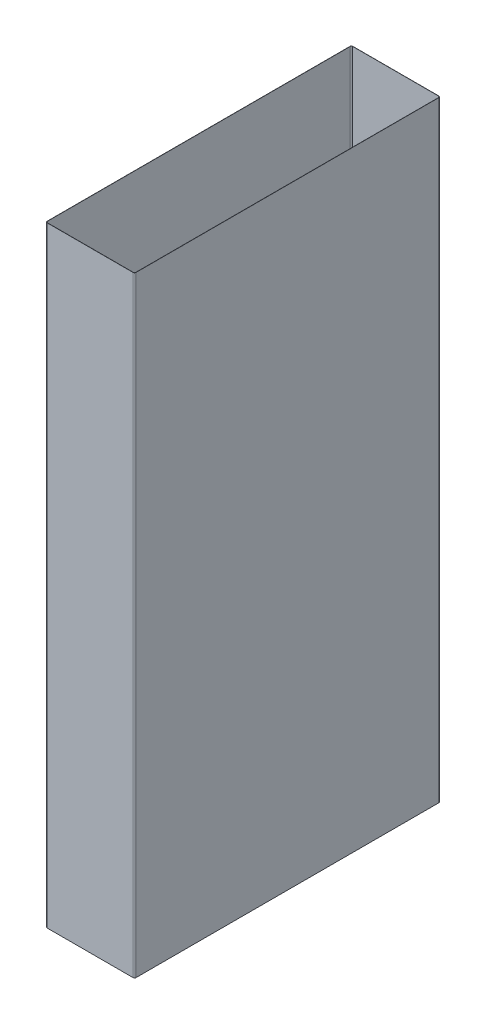
ISO-10303-21;
HEADER;
FILE_DESCRIPTION(('STEP AP214'),'2;1');
FILE_NAME('part.step','',(''),(''),'','','');
FILE_SCHEMA(('AUTOMOTIVE_DESIGN { 1 0 10303 214 1 1 1 1 }'));
ENDSEC;
DATA;
#1=APPLICATION_CONTEXT('core data for automotive mechanical design processes');
#2=APPLICATION_PROTOCOL_DEFINITION('international standard','automotive_design',2000,#1);
#3=PRODUCT_CONTEXT('',#1,'mechanical');
#4=PRODUCT('Part','Part','',(#3));
#5=PRODUCT_RELATED_PRODUCT_CATEGORY('part','',(#4));
#6=PRODUCT_DEFINITION_FORMATION('','',#4);
#7=PRODUCT_DEFINITION_CONTEXT('part definition',#1,'design');
#8=PRODUCT_DEFINITION('design','',#6,#7);
#9=PRODUCT_DEFINITION_SHAPE('','',#8);
#10=(LENGTH_UNIT() NAMED_UNIT(*) SI_UNIT(.MILLI.,.METRE.));
#11=(NAMED_UNIT(*) PLANE_ANGLE_UNIT() SI_UNIT($,.RADIAN.));
#12=(NAMED_UNIT(*) SI_UNIT($,.STERADIAN.) SOLID_ANGLE_UNIT());
#13=UNCERTAINTY_MEASURE_WITH_UNIT(LENGTH_MEASURE(1.E-05),#10,'distance_accuracy_value','');
#14=(GEOMETRIC_REPRESENTATION_CONTEXT(3) GLOBAL_UNCERTAINTY_ASSIGNED_CONTEXT((#13)) GLOBAL_UNIT_ASSIGNED_CONTEXT((#10,
#11,#12)) REPRESENTATION_CONTEXT('',''));
#15=CARTESIAN_POINT('',(0.,0.,0.));
#16=DIRECTION('',(0.,0.,1.));
#17=DIRECTION('',(1.,0.,0.));
#18=AXIS2_PLACEMENT_3D('',#15,#16,#17);
#19=CARTESIAN_POINT('',(1.,484.8,-1.));
#20=DIRECTION('',(0.,-1.,0.));
#21=DIRECTION('',(0.,0.,-1.));
#22=AXIS2_PLACEMENT_3D('',#19,#20,#21);
#23=PLANE('',#22);
#24=CARTESIAN_POINT('',(1.,484.8,-1.));
#25=DIRECTION('',(0.,-1.,0.));
#26=DIRECTION('',(-1.,0.,0.));
#27=AXIS2_PLACEMENT_3D('',#24,#25,#26);
#28=CIRCLE('',#27,1.15);
#29=CARTESIAN_POINT('',(-0.15,484.8,-1.00000000000001));
#30=VERTEX_POINT('',#29);
#31=CARTESIAN_POINT('',(1.00000000000001,484.8,0.15));
#32=VERTEX_POINT('',#31);
#33=EDGE_CURVE('E261',#30,#32,#28,.F.);
#34=ORIENTED_EDGE('',*,*,#33,.T.);
#35=DIRECTION('',(1.,0.,0.));
#36=VECTOR('',#35,1.);
#37=CARTESIAN_POINT('',(1.,484.8,0.15));
#38=LINE('',#37,#36);
#39=CARTESIAN_POINT('',(69.2,484.8,0.15));
#40=VERTEX_POINT('',#39);
#41=EDGE_CURVE('E264',#32,#40,#38,.T.);
#42=ORIENTED_EDGE('',*,*,#41,.T.);
#43=CARTESIAN_POINT('',(69.2,484.8,-1.));
#44=DIRECTION('',(0.,-1.,0.));
#45=DIRECTION('',(-1.,0.,0.));
#46=AXIS2_PLACEMENT_3D('',#43,#44,#45);
#47=CIRCLE('',#46,1.15);
#48=CARTESIAN_POINT('',(70.35,484.8,-1.));
#49=VERTEX_POINT('',#48);
#50=EDGE_CURVE('E267',#40,#49,#47,.F.);
#51=ORIENTED_EDGE('',*,*,#50,.T.);
#52=DIRECTION('',(0.,0.,-1.));
#53=VECTOR('',#52,1.);
#54=CARTESIAN_POINT('',(70.35,484.8,-1.));
#55=LINE('',#54,#53);
#56=CARTESIAN_POINT('',(70.35,484.8,-241.4));
#57=VERTEX_POINT('',#56);
#58=EDGE_CURVE('E269',#49,#57,#55,.T.);
#59=ORIENTED_EDGE('',*,*,#58,.T.);
#60=CARTESIAN_POINT('',(69.2,484.8,-241.4));
#61=DIRECTION('',(0.,-1.,0.));
#62=DIRECTION('',(-1.,0.,0.));
#63=AXIS2_PLACEMENT_3D('',#60,#61,#62);
#64=CIRCLE('',#63,1.15);
#65=CARTESIAN_POINT('',(69.2,484.8,-242.55));
#66=VERTEX_POINT('',#65);
#67=EDGE_CURVE('E271',#57,#66,#64,.F.);
#68=ORIENTED_EDGE('',*,*,#67,.T.);
#69=DIRECTION('',(-1.,0.,0.));
#70=VECTOR('',#69,1.);
#71=CARTESIAN_POINT('',(1.,484.8,-242.55));
#72=LINE('',#71,#70);
#73=CARTESIAN_POINT('',(1.,484.8,-242.55));
#74=VERTEX_POINT('',#73);
#75=EDGE_CURVE('E273',#66,#74,#72,.T.);
#76=ORIENTED_EDGE('',*,*,#75,.T.);
#77=CARTESIAN_POINT('',(1.,484.8,-241.4));
#78=DIRECTION('',(0.,-1.,0.));
#79=DIRECTION('',(-1.,0.,0.));
#80=AXIS2_PLACEMENT_3D('',#77,#78,#79);
#81=CIRCLE('',#80,1.15);
#82=CARTESIAN_POINT('',(-0.15,484.8,-241.4));
#83=VERTEX_POINT('',#82);
#84=EDGE_CURVE('E275',#74,#83,#81,.F.);
#85=ORIENTED_EDGE('',*,*,#84,.T.);
#86=DIRECTION('',(0.,0.,1.));
#87=VECTOR('',#86,1.);
#88=CARTESIAN_POINT('',(-0.15,484.8,-1.));
#89=LINE('',#88,#87);
#90=EDGE_CURVE('E277',#83,#30,#89,.T.);
#91=ORIENTED_EDGE('',*,*,#90,.T.);
#92=EDGE_LOOP('',(#34,#42,#51,#59,#68,#76,#85,#91));
#93=FACE_BOUND('',#92,.T.);
#94=CARTESIAN_POINT('',(1.,484.8,-1.));
#95=DIRECTION('',(0.,1.,0.));
#96=DIRECTION('',(0.,0.,-1.));
#97=AXIS2_PLACEMENT_3D('',#94,#95,#96);
#98=CIRCLE('',#97,1.);
#99=CARTESIAN_POINT('',(0.,484.8,-1.00000000000001));
#100=VERTEX_POINT('',#99);
#101=CARTESIAN_POINT('',(1.00000000000001,484.8,0.));
#102=VERTEX_POINT('',#101);
#103=EDGE_CURVE('E196',#100,#102,#98,.T.);
#104=ORIENTED_EDGE('',*,*,#103,.F.);
#105=DIRECTION('',(0.,0.,1.));
#106=VECTOR('',#105,1.);
#107=CARTESIAN_POINT('',(0.,484.8,-1.00000000000001));
#108=LINE('',#107,#106);
#109=CARTESIAN_POINT('',(0.,484.8,-241.4));
#110=VERTEX_POINT('',#109);
#111=EDGE_CURVE('E229',#110,#100,#108,.T.);
#112=ORIENTED_EDGE('',*,*,#111,.F.);
#113=CARTESIAN_POINT('',(1.,484.8,-241.4));
#114=DIRECTION('',(0.,1.,0.));
#115=DIRECTION('',(0.,0.,-1.));
#116=AXIS2_PLACEMENT_3D('',#113,#114,#115);
#117=CIRCLE('',#116,1.);
#118=CARTESIAN_POINT('',(1.,484.8,-242.4));
#119=VERTEX_POINT('',#118);
#120=EDGE_CURVE('E227',#119,#110,#117,.T.);
#121=ORIENTED_EDGE('',*,*,#120,.F.);
#122=DIRECTION('',(-1.,0.,0.));
#123=VECTOR('',#122,1.);
#124=CARTESIAN_POINT('',(1.,484.8,-242.4));
#125=LINE('',#124,#123);
#126=CARTESIAN_POINT('',(69.2,484.8,-242.4));
#127=VERTEX_POINT('',#126);
#128=EDGE_CURVE('E225',#127,#119,#125,.T.);
#129=ORIENTED_EDGE('',*,*,#128,.F.);
#130=CARTESIAN_POINT('',(69.2,484.8,-241.4));
#131=DIRECTION('',(0.,1.,0.));
#132=DIRECTION('',(0.,0.,-1.));
#133=AXIS2_PLACEMENT_3D('',#130,#131,#132);
#134=CIRCLE('',#133,1.);
#135=CARTESIAN_POINT('',(70.2,484.8,-241.4));
#136=VERTEX_POINT('',#135);
#137=EDGE_CURVE('E223',#136,#127,#134,.T.);
#138=ORIENTED_EDGE('',*,*,#137,.F.);
#139=DIRECTION('',(0.,0.,-1.));
#140=VECTOR('',#139,1.);
#141=CARTESIAN_POINT('',(70.2,484.8,-1.));
#142=LINE('',#141,#140);
#143=CARTESIAN_POINT('',(70.2,484.8,-1.));
#144=VERTEX_POINT('',#143);
#145=EDGE_CURVE('E219',#144,#136,#142,.T.);
#146=ORIENTED_EDGE('',*,*,#145,.F.);
#147=CARTESIAN_POINT('',(69.2,484.8,-1.));
#148=DIRECTION('',(0.,1.,0.));
#149=DIRECTION('',(0.,0.,1.));
#150=AXIS2_PLACEMENT_3D('',#147,#148,#149);
#151=CIRCLE('',#150,1.);
#152=CARTESIAN_POINT('',(69.2,484.8,0.));
#153=VERTEX_POINT('',#152);
#154=EDGE_CURVE('E217',#153,#144,#151,.T.);
#155=ORIENTED_EDGE('',*,*,#154,.F.);
#156=DIRECTION('',(1.,0.,0.));
#157=VECTOR('',#156,1.);
#158=CARTESIAN_POINT('',(1.00000000000001,484.8,0.));
#159=LINE('',#158,#157);
#160=EDGE_CURVE('E204',#102,#153,#159,.T.);
#161=ORIENTED_EDGE('',*,*,#160,.F.);
#162=EDGE_LOOP('',(#104,#112,#121,#129,#138,#146,#155,#161));
#163=FACE_BOUND('',#162,.T.);
#164=ADVANCED_FACE('F83',(#93,#163),#23,.F.);
#165=CARTESIAN_POINT('',(1.,0.,-1.));
#166=DIRECTION('',(0.,-1.,0.));
#167=DIRECTION('',(0.,0.,-1.));
#168=AXIS2_PLACEMENT_3D('',#165,#166,#167);
#169=PLANE('',#168);
#170=CARTESIAN_POINT('',(1.,0.,-1.));
#171=DIRECTION('',(0.,-1.,0.));
#172=DIRECTION('',(-1.,0.,0.));
#173=AXIS2_PLACEMENT_3D('',#170,#171,#172);
#174=CIRCLE('',#173,1.15);
#175=CARTESIAN_POINT('',(-0.15,0.,-1.00000000000001));
#176=VERTEX_POINT('',#175);
#177=CARTESIAN_POINT('',(1.00000000000001,0.,0.15));
#178=VERTEX_POINT('',#177);
#179=EDGE_CURVE('E212',#176,#178,#174,.F.);
#180=ORIENTED_EDGE('',*,*,#179,.F.);
#181=DIRECTION('',(0.,0.,1.));
#182=VECTOR('',#181,1.);
#183=CARTESIAN_POINT('',(-0.15,0.,-1.));
#184=LINE('',#183,#182);
#185=CARTESIAN_POINT('',(-0.15,0.,-241.4));
#186=VERTEX_POINT('',#185);
#187=EDGE_CURVE('E265',#186,#176,#184,.T.);
#188=ORIENTED_EDGE('',*,*,#187,.F.);
#189=CARTESIAN_POINT('',(1.,0.,-241.4));
#190=DIRECTION('',(0.,-1.,0.));
#191=DIRECTION('',(-1.,0.,0.));
#192=AXIS2_PLACEMENT_3D('',#189,#190,#191);
#193=CIRCLE('',#192,1.15);
#194=CARTESIAN_POINT('',(1.,0.,-242.55));
#195=VERTEX_POINT('',#194);
#196=EDGE_CURVE('E292',#195,#186,#193,.F.);
#197=ORIENTED_EDGE('',*,*,#196,.F.);
#198=DIRECTION('',(-1.,0.,0.));
#199=VECTOR('',#198,1.);
#200=CARTESIAN_POINT('',(1.,0.,-242.55));
#201=LINE('',#200,#199);
#202=CARTESIAN_POINT('',(69.2,0.,-242.55));
#203=VERTEX_POINT('',#202);
#204=EDGE_CURVE('E290',#203,#195,#201,.T.);
#205=ORIENTED_EDGE('',*,*,#204,.F.);
#206=CARTESIAN_POINT('',(69.2,0.,-241.4));
#207=DIRECTION('',(0.,-1.,0.));
#208=DIRECTION('',(-1.,0.,0.));
#209=AXIS2_PLACEMENT_3D('',#206,#207,#208);
#210=CIRCLE('',#209,1.15);
#211=CARTESIAN_POINT('',(70.35,0.,-241.4));
#212=VERTEX_POINT('',#211);
#213=EDGE_CURVE('E288',#212,#203,#210,.F.);
#214=ORIENTED_EDGE('',*,*,#213,.F.);
#215=DIRECTION('',(0.,0.,-1.));
#216=VECTOR('',#215,1.);
#217=CARTESIAN_POINT('',(70.35,0.,-1.));
#218=LINE('',#217,#216);
#219=CARTESIAN_POINT('',(70.35,0.,-1.));
#220=VERTEX_POINT('',#219);
#221=EDGE_CURVE('E286',#220,#212,#218,.T.);
#222=ORIENTED_EDGE('',*,*,#221,.F.);
#223=CARTESIAN_POINT('',(69.2,0.,-1.));
#224=DIRECTION('',(0.,-1.,0.));
#225=DIRECTION('',(-1.,0.,0.));
#226=AXIS2_PLACEMENT_3D('',#223,#224,#225);
#227=CIRCLE('',#226,1.15);
#228=CARTESIAN_POINT('',(69.2,0.,0.15));
#229=VERTEX_POINT('',#228);
#230=EDGE_CURVE('E284',#229,#220,#227,.F.);
#231=ORIENTED_EDGE('',*,*,#230,.F.);
#232=DIRECTION('',(1.,0.,0.));
#233=VECTOR('',#232,1.);
#234=CARTESIAN_POINT('',(1.,0.,0.15));
#235=LINE('',#234,#233);
#236=EDGE_CURVE('E282',#178,#229,#235,.T.);
#237=ORIENTED_EDGE('',*,*,#236,.F.);
#238=EDGE_LOOP('',(#180,#188,#197,#205,#214,#222,#231,#237));
#239=FACE_BOUND('',#238,.T.);
#240=DIRECTION('',(0.,0.,1.));
#241=VECTOR('',#240,1.);
#242=CARTESIAN_POINT('',(0.,0.,-1.00000000000001));
#243=LINE('',#242,#241);
#244=CARTESIAN_POINT('',(0.,0.,-241.4));
#245=VERTEX_POINT('',#244);
#246=CARTESIAN_POINT('',(0.,0.,-1.00000000000001));
#247=VERTEX_POINT('',#246);
#248=EDGE_CURVE('E205',#245,#247,#243,.T.);
#249=ORIENTED_EDGE('',*,*,#248,.T.);
#250=CARTESIAN_POINT('',(1.,0.,-1.));
#251=DIRECTION('',(0.,1.,0.));
#252=DIRECTION('',(0.,0.,-1.));
#253=AXIS2_PLACEMENT_3D('',#250,#251,#252);
#254=CIRCLE('',#253,1.);
#255=CARTESIAN_POINT('',(1.00000000000001,0.,0.));
#256=VERTEX_POINT('',#255);
#257=EDGE_CURVE('E106',#247,#256,#254,.T.);
#258=ORIENTED_EDGE('',*,*,#257,.T.);
#259=DIRECTION('',(1.,0.,0.));
#260=VECTOR('',#259,1.);
#261=CARTESIAN_POINT('',(1.00000000000001,0.,0.));
#262=LINE('',#261,#260);
#263=CARTESIAN_POINT('',(69.2,0.,0.));
#264=VERTEX_POINT('',#263);
#265=EDGE_CURVE('E211',#256,#264,#262,.T.);
#266=ORIENTED_EDGE('',*,*,#265,.T.);
#267=CARTESIAN_POINT('',(69.2,0.,-1.));
#268=DIRECTION('',(0.,1.,0.));
#269=DIRECTION('',(0.,0.,1.));
#270=AXIS2_PLACEMENT_3D('',#267,#268,#269);
#271=CIRCLE('',#270,1.);
#272=CARTESIAN_POINT('',(70.2,0.,-1.));
#273=VERTEX_POINT('',#272);
#274=EDGE_CURVE('E233',#264,#273,#271,.T.);
#275=ORIENTED_EDGE('',*,*,#274,.T.);
#276=DIRECTION('',(0.,0.,-1.));
#277=VECTOR('',#276,1.);
#278=CARTESIAN_POINT('',(70.2,0.,-1.));
#279=LINE('',#278,#277);
#280=CARTESIAN_POINT('',(70.2,0.,-241.4));
#281=VERTEX_POINT('',#280);
#282=EDGE_CURVE('E236',#273,#281,#279,.T.);
#283=ORIENTED_EDGE('',*,*,#282,.T.);
#284=CARTESIAN_POINT('',(69.2,0.,-241.4));
#285=DIRECTION('',(0.,1.,0.));
#286=DIRECTION('',(0.,0.,-1.));
#287=AXIS2_PLACEMENT_3D('',#284,#285,#286);
#288=CIRCLE('',#287,1.);
#289=CARTESIAN_POINT('',(69.2,0.,-242.4));
#290=VERTEX_POINT('',#289);
#291=EDGE_CURVE('E239',#281,#290,#288,.T.);
#292=ORIENTED_EDGE('',*,*,#291,.T.);
#293=DIRECTION('',(-1.,0.,0.));
#294=VECTOR('',#293,1.);
#295=CARTESIAN_POINT('',(1.,0.,-242.4));
#296=LINE('',#295,#294);
#297=CARTESIAN_POINT('',(1.,0.,-242.4));
#298=VERTEX_POINT('',#297);
#299=EDGE_CURVE('E242',#290,#298,#296,.T.);
#300=ORIENTED_EDGE('',*,*,#299,.T.);
#301=CARTESIAN_POINT('',(1.,0.,-241.4));
#302=DIRECTION('',(0.,1.,0.));
#303=DIRECTION('',(0.,0.,-1.));
#304=AXIS2_PLACEMENT_3D('',#301,#302,#303);
#305=CIRCLE('',#304,1.);
#306=EDGE_CURVE('E245',#298,#245,#305,.T.);
#307=ORIENTED_EDGE('',*,*,#306,.T.);
#308=EDGE_LOOP('',(#249,#258,#266,#275,#283,#292,#300,#307));
#309=FACE_BOUND('',#308,.T.);
#310=ADVANCED_FACE('F322',(#239,#309),#169,.T.);
#311=CARTESIAN_POINT('',(1.,484.8,-1.));
#312=DIRECTION('',(0.,-1.,0.));
#313=DIRECTION('',(0.,0.,-1.));
#314=AXIS2_PLACEMENT_3D('',#311,#312,#313);
#315=CYLINDRICAL_SURFACE('',#314,1.15);
#316=ORIENTED_EDGE('',*,*,#179,.T.);
#317=DIRECTION('',(0.,-1.,0.));
#318=VECTOR('',#317,1.);
#319=CARTESIAN_POINT('',(1.00000000000001,484.8,0.15));
#320=LINE('',#319,#318);
#321=EDGE_CURVE('E12',#32,#178,#320,.T.);
#322=ORIENTED_EDGE('',*,*,#321,.F.);
#323=ORIENTED_EDGE('',*,*,#33,.F.);
#324=DIRECTION('',(0.,-1.,0.));
#325=VECTOR('',#324,1.);
#326=CARTESIAN_POINT('',(-0.15,484.8,-1.00000000000001));
#327=LINE('',#326,#325);
#328=EDGE_CURVE('E279',#30,#176,#327,.T.);
#329=ORIENTED_EDGE('',*,*,#328,.T.);
#330=EDGE_LOOP('',(#316,#322,#323,#329));
#331=FACE_BOUND('',#330,.T.);
#332=ADVANCED_FACE('F85',(#331),#315,.T.);
#333=CARTESIAN_POINT('',(1.,484.8,0.15));
#334=DIRECTION('',(0.,0.,-1.));
#335=DIRECTION('',(-1.,0.,0.));
#336=AXIS2_PLACEMENT_3D('',#333,#334,#335);
#337=PLANE('',#336);
#338=ORIENTED_EDGE('',*,*,#236,.T.);
#339=DIRECTION('',(0.,-1.,0.));
#340=VECTOR('',#339,1.);
#341=CARTESIAN_POINT('',(69.2,484.8,0.15));
#342=LINE('',#341,#340);
#343=EDGE_CURVE('E91',#40,#229,#342,.T.);
#344=ORIENTED_EDGE('',*,*,#343,.F.);
#345=ORIENTED_EDGE('',*,*,#41,.F.);
#346=ORIENTED_EDGE('',*,*,#321,.T.);
#347=EDGE_LOOP('',(#338,#344,#345,#346));
#348=FACE_BOUND('',#347,.T.);
#349=ADVANCED_FACE('F339',(#348),#337,.F.);
#350=CARTESIAN_POINT('',(69.2,484.8,-1.));
#351=DIRECTION('',(0.,-1.,0.));
#352=DIRECTION('',(0.,0.,-1.));
#353=AXIS2_PLACEMENT_3D('',#350,#351,#352);
#354=CYLINDRICAL_SURFACE('',#353,1.15);
#355=ORIENTED_EDGE('',*,*,#230,.T.);
#356=DIRECTION('',(0.,-1.,0.));
#357=VECTOR('',#356,1.);
#358=CARTESIAN_POINT('',(70.35,484.8,-1.));
#359=LINE('',#358,#357);
#360=EDGE_CURVE('E309',#49,#220,#359,.T.);
#361=ORIENTED_EDGE('',*,*,#360,.F.);
#362=ORIENTED_EDGE('',*,*,#50,.F.);
#363=ORIENTED_EDGE('',*,*,#343,.T.);
#364=EDGE_LOOP('',(#355,#361,#362,#363));
#365=FACE_BOUND('',#364,.T.);
#366=ADVANCED_FACE('F316',(#365),#354,.T.);
#367=CARTESIAN_POINT('',(70.35,484.8,-1.));
#368=DIRECTION('',(-1.,0.,0.));
#369=DIRECTION('',(0.,0.,1.));
#370=AXIS2_PLACEMENT_3D('',#367,#368,#369);
#371=PLANE('',#370);
#372=ORIENTED_EDGE('',*,*,#221,.T.);
#373=DIRECTION('',(0.,-1.,0.));
#374=VECTOR('',#373,1.);
#375=CARTESIAN_POINT('',(70.35,484.8,-241.4));
#376=LINE('',#375,#374);
#377=EDGE_CURVE('E306',#57,#212,#376,.T.);
#378=ORIENTED_EDGE('',*,*,#377,.F.);
#379=ORIENTED_EDGE('',*,*,#58,.F.);
#380=ORIENTED_EDGE('',*,*,#360,.T.);
#381=EDGE_LOOP('',(#372,#378,#379,#380));
#382=FACE_BOUND('',#381,.T.);
#383=ADVANCED_FACE('F328',(#382),#371,.F.);
#384=CARTESIAN_POINT('',(69.2,484.8,-241.4));
#385=DIRECTION('',(0.,-1.,0.));
#386=DIRECTION('',(0.,0.,-1.));
#387=AXIS2_PLACEMENT_3D('',#384,#385,#386);
#388=CYLINDRICAL_SURFACE('',#387,1.15);
#389=ORIENTED_EDGE('',*,*,#213,.T.);
#390=DIRECTION('',(0.,-1.,0.));
#391=VECTOR('',#390,1.);
#392=CARTESIAN_POINT('',(69.2,484.8,-242.55));
#393=LINE('',#392,#391);
#394=EDGE_CURVE('E303',#66,#203,#393,.T.);
#395=ORIENTED_EDGE('',*,*,#394,.F.);
#396=ORIENTED_EDGE('',*,*,#67,.F.);
#397=ORIENTED_EDGE('',*,*,#377,.T.);
#398=EDGE_LOOP('',(#389,#395,#396,#397));
#399=FACE_BOUND('',#398,.T.);
#400=ADVANCED_FACE('F332',(#399),#388,.T.);
#401=CARTESIAN_POINT('',(1.,484.8,-242.55));
#402=DIRECTION('',(0.,0.,1.));
#403=DIRECTION('',(1.,0.,0.));
#404=AXIS2_PLACEMENT_3D('',#401,#402,#403);
#405=PLANE('',#404);
#406=ORIENTED_EDGE('',*,*,#204,.T.);
#407=DIRECTION('',(0.,-1.,0.));
#408=VECTOR('',#407,1.);
#409=CARTESIAN_POINT('',(1.,484.8,-242.55));
#410=LINE('',#409,#408);
#411=EDGE_CURVE('E300',#74,#195,#410,.T.);
#412=ORIENTED_EDGE('',*,*,#411,.F.);
#413=ORIENTED_EDGE('',*,*,#75,.F.);
#414=ORIENTED_EDGE('',*,*,#394,.T.);
#415=EDGE_LOOP('',(#406,#412,#413,#414));
#416=FACE_BOUND('',#415,.T.);
#417=ADVANCED_FACE('F352',(#416),#405,.F.);
#418=CARTESIAN_POINT('',(1.,484.8,-241.4));
#419=DIRECTION('',(0.,-1.,0.));
#420=DIRECTION('',(0.,0.,-1.));
#421=AXIS2_PLACEMENT_3D('',#418,#419,#420);
#422=CYLINDRICAL_SURFACE('',#421,1.15);
#423=ORIENTED_EDGE('',*,*,#196,.T.);
#424=DIRECTION('',(0.,-1.,0.));
#425=VECTOR('',#424,1.);
#426=CARTESIAN_POINT('',(-0.15,484.8,-241.4));
#427=LINE('',#426,#425);
#428=EDGE_CURVE('E297',#83,#186,#427,.T.);
#429=ORIENTED_EDGE('',*,*,#428,.F.);
#430=ORIENTED_EDGE('',*,*,#84,.F.);
#431=ORIENTED_EDGE('',*,*,#411,.T.);
#432=EDGE_LOOP('',(#423,#429,#430,#431));
#433=FACE_BOUND('',#432,.T.);
#434=ADVANCED_FACE('F350',(#433),#422,.T.);
#435=CARTESIAN_POINT('',(-0.15,484.8,-1.));
#436=DIRECTION('',(1.,0.,0.));
#437=DIRECTION('',(0.,0.,-1.));
#438=AXIS2_PLACEMENT_3D('',#435,#436,#437);
#439=PLANE('',#438);
#440=ORIENTED_EDGE('',*,*,#187,.T.);
#441=ORIENTED_EDGE('',*,*,#328,.F.);
#442=ORIENTED_EDGE('',*,*,#90,.F.);
#443=ORIENTED_EDGE('',*,*,#428,.T.);
#444=EDGE_LOOP('',(#440,#441,#442,#443));
#445=FACE_BOUND('',#444,.T.);
#446=ADVANCED_FACE('F345',(#445),#439,.F.);
#447=CARTESIAN_POINT('',(1.,484.8,-1.));
#448=DIRECTION('',(0.,-1.,0.));
#449=DIRECTION('',(0.,0.,-1.));
#450=AXIS2_PLACEMENT_3D('',#447,#448,#449);
#451=CYLINDRICAL_SURFACE('',#450,1.);
#452=ORIENTED_EDGE('',*,*,#257,.F.);
#453=DIRECTION('',(0.,-1.,0.));
#454=VECTOR('',#453,1.);
#455=CARTESIAN_POINT('',(0.,484.8,-1.00000000000001));
#456=LINE('',#455,#454);
#457=EDGE_CURVE('E200',#100,#247,#456,.T.);
#458=ORIENTED_EDGE('',*,*,#457,.F.);
#459=ORIENTED_EDGE('',*,*,#103,.T.);
#460=DIRECTION('',(0.,-1.,0.));
#461=VECTOR('',#460,1.);
#462=CARTESIAN_POINT('',(1.00000000000001,484.8,0.));
#463=LINE('',#462,#461);
#464=EDGE_CURVE('E199',#102,#256,#463,.T.);
#465=ORIENTED_EDGE('',*,*,#464,.T.);
#466=EDGE_LOOP('',(#452,#458,#459,#465));
#467=FACE_BOUND('',#466,.T.);
#468=ADVANCED_FACE('F198',(#467),#451,.F.);
#469=CARTESIAN_POINT('',(1.00000000000001,484.8,0.));
#470=DIRECTION('',(0.,0.,-1.));
#471=DIRECTION('',(-1.,0.,0.));
#472=AXIS2_PLACEMENT_3D('',#469,#470,#471);
#473=PLANE('',#472);
#474=ORIENTED_EDGE('',*,*,#265,.F.);
#475=ORIENTED_EDGE('',*,*,#464,.F.);
#476=ORIENTED_EDGE('',*,*,#160,.T.);
#477=DIRECTION('',(0.,-1.,0.));
#478=VECTOR('',#477,1.);
#479=CARTESIAN_POINT('',(69.2,484.8,0.));
#480=LINE('',#479,#478);
#481=EDGE_CURVE('E213',#153,#264,#480,.T.);
#482=ORIENTED_EDGE('',*,*,#481,.T.);
#483=EDGE_LOOP('',(#474,#475,#476,#482));
#484=FACE_BOUND('',#483,.T.);
#485=ADVANCED_FACE('F208',(#484),#473,.T.);
#486=CARTESIAN_POINT('',(69.2,484.8,-1.));
#487=DIRECTION('',(0.,-1.,0.));
#488=DIRECTION('',(0.,0.,-1.));
#489=AXIS2_PLACEMENT_3D('',#486,#487,#488);
#490=CYLINDRICAL_SURFACE('',#489,1.);
#491=ORIENTED_EDGE('',*,*,#274,.F.);
#492=ORIENTED_EDGE('',*,*,#481,.F.);
#493=ORIENTED_EDGE('',*,*,#154,.T.);
#494=DIRECTION('',(0.,-1.,0.));
#495=VECTOR('',#494,1.);
#496=CARTESIAN_POINT('',(70.2,484.8,-1.));
#497=LINE('',#496,#495);
#498=EDGE_CURVE('E258',#144,#273,#497,.T.);
#499=ORIENTED_EDGE('',*,*,#498,.T.);
#500=EDGE_LOOP('',(#491,#492,#493,#499));
#501=FACE_BOUND('',#500,.T.);
#502=ADVANCED_FACE('F377',(#501),#490,.F.);
#503=CARTESIAN_POINT('',(70.2,484.8,-1.));
#504=DIRECTION('',(-1.,0.,0.));
#505=DIRECTION('',(0.,0.,1.));
#506=AXIS2_PLACEMENT_3D('',#503,#504,#505);
#507=PLANE('',#506);
#508=ORIENTED_EDGE('',*,*,#282,.F.);
#509=ORIENTED_EDGE('',*,*,#498,.F.);
#510=ORIENTED_EDGE('',*,*,#145,.T.);
#511=DIRECTION('',(0.,-1.,0.));
#512=VECTOR('',#511,1.);
#513=CARTESIAN_POINT('',(70.2,484.8,-241.4));
#514=LINE('',#513,#512);
#515=EDGE_CURVE('E256',#136,#281,#514,.T.);
#516=ORIENTED_EDGE('',*,*,#515,.T.);
#517=EDGE_LOOP('',(#508,#509,#510,#516));
#518=FACE_BOUND('',#517,.T.);
#519=ADVANCED_FACE('F381',(#518),#507,.T.);
#520=CARTESIAN_POINT('',(69.2,484.8,-241.4));
#521=DIRECTION('',(0.,-1.,0.));
#522=DIRECTION('',(0.,0.,-1.));
#523=AXIS2_PLACEMENT_3D('',#520,#521,#522);
#524=CYLINDRICAL_SURFACE('',#523,1.);
#525=ORIENTED_EDGE('',*,*,#291,.F.);
#526=ORIENTED_EDGE('',*,*,#515,.F.);
#527=ORIENTED_EDGE('',*,*,#137,.T.);
#528=DIRECTION('',(0.,-1.,0.));
#529=VECTOR('',#528,1.);
#530=CARTESIAN_POINT('',(69.2,484.8,-242.4));
#531=LINE('',#530,#529);
#532=EDGE_CURVE('E254',#127,#290,#531,.T.);
#533=ORIENTED_EDGE('',*,*,#532,.T.);
#534=EDGE_LOOP('',(#525,#526,#527,#533));
#535=FACE_BOUND('',#534,.T.);
#536=ADVANCED_FACE('F387',(#535),#524,.F.);
#537=CARTESIAN_POINT('',(1.,484.8,-242.4));
#538=DIRECTION('',(0.,0.,1.));
#539=DIRECTION('',(1.,0.,0.));
#540=AXIS2_PLACEMENT_3D('',#537,#538,#539);
#541=PLANE('',#540);
#542=ORIENTED_EDGE('',*,*,#299,.F.);
#543=ORIENTED_EDGE('',*,*,#532,.F.);
#544=ORIENTED_EDGE('',*,*,#128,.T.);
#545=DIRECTION('',(0.,-1.,0.));
#546=VECTOR('',#545,1.);
#547=CARTESIAN_POINT('',(1.,484.8,-242.4));
#548=LINE('',#547,#546);
#549=EDGE_CURVE('E252',#119,#298,#548,.T.);
#550=ORIENTED_EDGE('',*,*,#549,.T.);
#551=EDGE_LOOP('',(#542,#543,#544,#550));
#552=FACE_BOUND('',#551,.T.);
#553=ADVANCED_FACE('F391',(#552),#541,.T.);
#554=CARTESIAN_POINT('',(1.,484.8,-241.4));
#555=DIRECTION('',(0.,-1.,0.));
#556=DIRECTION('',(0.,0.,-1.));
#557=AXIS2_PLACEMENT_3D('',#554,#555,#556);
#558=CYLINDRICAL_SURFACE('',#557,1.);
#559=ORIENTED_EDGE('',*,*,#306,.F.);
#560=ORIENTED_EDGE('',*,*,#549,.F.);
#561=ORIENTED_EDGE('',*,*,#120,.T.);
#562=DIRECTION('',(0.,-1.,0.));
#563=VECTOR('',#562,1.);
#564=CARTESIAN_POINT('',(0.,484.8,-241.4));
#565=LINE('',#564,#563);
#566=EDGE_CURVE('E98',#110,#245,#565,.T.);
#567=ORIENTED_EDGE('',*,*,#566,.T.);
#568=EDGE_LOOP('',(#559,#560,#561,#567));
#569=FACE_BOUND('',#568,.T.);
#570=ADVANCED_FACE('F395',(#569),#558,.F.);
#571=CARTESIAN_POINT('',(0.,484.8,-1.00000000000001));
#572=DIRECTION('',(1.,0.,0.));
#573=DIRECTION('',(0.,0.,-1.));
#574=AXIS2_PLACEMENT_3D('',#571,#572,#573);
#575=PLANE('',#574);
#576=ORIENTED_EDGE('',*,*,#248,.F.);
#577=ORIENTED_EDGE('',*,*,#566,.F.);
#578=ORIENTED_EDGE('',*,*,#111,.T.);
#579=ORIENTED_EDGE('',*,*,#457,.T.);
#580=EDGE_LOOP('',(#576,#577,#578,#579));
#581=FACE_BOUND('',#580,.T.);
#582=ADVANCED_FACE('F399',(#581),#575,.T.);
#583=CLOSED_SHELL('',(#164,#310,#332,#349,#366,#383,#400,#417,#434,#446,#468,#485,#502,#519,
#536,#553,#570,#582));
#584=MANIFOLD_SOLID_BREP('B2',#583);
#585=ADVANCED_BREP_SHAPE_REPRESENTATION('',(#18,#584),#14);
#586=SHAPE_DEFINITION_REPRESENTATION(#9,#585);
ENDSEC;
END-ISO-10303-21;
